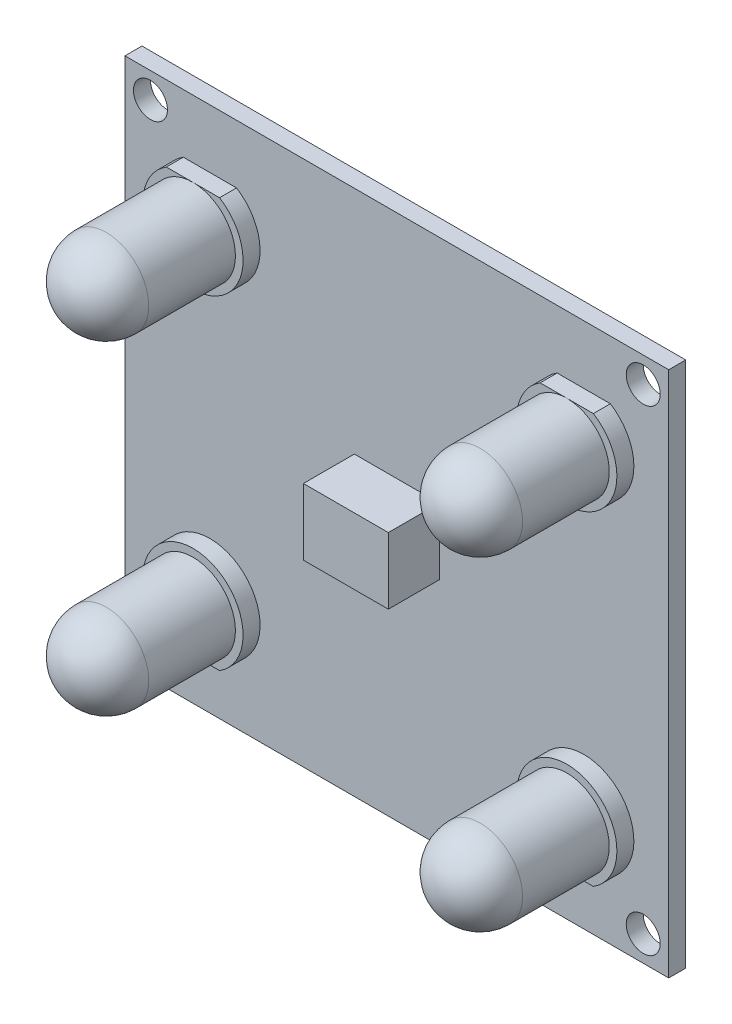
ISO-10303-21;
HEADER;
FILE_DESCRIPTION(('STEP AP214'),'2;1');
FILE_NAME('part.step','',(''),(''),'','','');
FILE_SCHEMA(('AUTOMOTIVE_DESIGN { 1 0 10303 214 1 1 1 1 }'));
ENDSEC;
DATA;
#1=APPLICATION_CONTEXT('core data for automotive mechanical design processes');
#2=APPLICATION_PROTOCOL_DEFINITION('international standard','automotive_design',2000,#1);
#3=PRODUCT_CONTEXT('',#1,'mechanical');
#4=PRODUCT('Part','Part','',(#3));
#5=PRODUCT_RELATED_PRODUCT_CATEGORY('part','',(#4));
#6=PRODUCT_DEFINITION_FORMATION('','',#4);
#7=PRODUCT_DEFINITION_CONTEXT('part definition',#1,'design');
#8=PRODUCT_DEFINITION('design','',#6,#7);
#9=PRODUCT_DEFINITION_SHAPE('','',#8);
#10=(LENGTH_UNIT() NAMED_UNIT(*) SI_UNIT(.MILLI.,.METRE.));
#11=(NAMED_UNIT(*) PLANE_ANGLE_UNIT() SI_UNIT($,.RADIAN.));
#12=(NAMED_UNIT(*) SI_UNIT($,.STERADIAN.) SOLID_ANGLE_UNIT());
#13=UNCERTAINTY_MEASURE_WITH_UNIT(LENGTH_MEASURE(1.E-05),#10,'distance_accuracy_value','');
#14=(GEOMETRIC_REPRESENTATION_CONTEXT(3) GLOBAL_UNCERTAINTY_ASSIGNED_CONTEXT((#13)) GLOBAL_UNIT_ASSIGNED_CONTEXT((#10,
#11,#12)) REPRESENTATION_CONTEXT('',''));
#15=CARTESIAN_POINT('',(0.,0.,0.));
#16=DIRECTION('',(0.,0.,1.));
#17=DIRECTION('',(1.,0.,0.));
#18=AXIS2_PLACEMENT_3D('',#15,#16,#17);
#19=CARTESIAN_POINT('',(-3.6257142857143,7.83026785714285,4.));
#20=DIRECTION('',(-1.,0.,0.));
#21=DIRECTION('',(0.,0.,1.));
#22=AXIS2_PLACEMENT_3D('',#19,#20,#21);
#23=PLANE('',#22);
#24=DIRECTION('',(0.,1.,0.));
#25=VECTOR('',#24,1.);
#26=CARTESIAN_POINT('',(-3.6257142857143,7.83026785714285,1.));
#27=LINE('',#26,#25);
#28=CARTESIAN_POINT('',(-3.6257142857143,3.92401785714286,1.));
#29=VERTEX_POINT('',#28);
#30=CARTESIAN_POINT('',(-3.6257142857143,7.83026785714285,1.));
#31=VERTEX_POINT('',#30);
#32=EDGE_CURVE('E116',#29,#31,#27,.T.);
#33=ORIENTED_EDGE('',*,*,#32,.T.);
#34=DIRECTION('',(0.,0.,-1.));
#35=VECTOR('',#34,1.);
#36=CARTESIAN_POINT('',(-3.6257142857143,7.83026785714285,4.));
#37=LINE('',#36,#35);
#38=CARTESIAN_POINT('',(-3.6257142857143,7.83026785714285,4.));
#39=VERTEX_POINT('',#38);
#40=EDGE_CURVE('E12',#39,#31,#37,.T.);
#41=ORIENTED_EDGE('',*,*,#40,.F.);
#42=DIRECTION('',(0.,1.,0.));
#43=VECTOR('',#42,1.);
#44=CARTESIAN_POINT('',(-3.6257142857143,7.83026785714285,4.));
#45=LINE('',#44,#43);
#46=CARTESIAN_POINT('',(-3.6257142857143,3.92401785714286,4.));
#47=VERTEX_POINT('',#46);
#48=EDGE_CURVE('E104',#47,#39,#45,.T.);
#49=ORIENTED_EDGE('',*,*,#48,.F.);
#50=DIRECTION('',(0.,0.,-1.));
#51=VECTOR('',#50,1.);
#52=CARTESIAN_POINT('',(-3.6257142857143,3.92401785714286,4.));
#53=LINE('',#52,#51);
#54=EDGE_CURVE('E112',#47,#29,#53,.T.);
#55=ORIENTED_EDGE('',*,*,#54,.T.);
#56=EDGE_LOOP('',(#33,#41,#49,#55));
#57=FACE_BOUND('',#56,.T.);
#58=ADVANCED_FACE('F53',(#57),#23,.F.);
#59=CARTESIAN_POINT('',(-8.6257142857143,7.83026785714285,4.));
#60=DIRECTION('',(0.,-1.,0.));
#61=DIRECTION('',(0.,0.,-1.));
#62=AXIS2_PLACEMENT_3D('',#59,#60,#61);
#63=PLANE('',#62);
#64=DIRECTION('',(-1.,0.,0.));
#65=VECTOR('',#64,1.);
#66=CARTESIAN_POINT('',(-8.6257142857143,7.83026785714285,1.));
#67=LINE('',#66,#65);
#68=CARTESIAN_POINT('',(-8.6257142857143,7.83026785714285,1.));
#69=VERTEX_POINT('',#68);
#70=EDGE_CURVE('E108',#31,#69,#67,.T.);
#71=ORIENTED_EDGE('',*,*,#70,.T.);
#72=DIRECTION('',(0.,0.,-1.));
#73=VECTOR('',#72,1.);
#74=CARTESIAN_POINT('',(-8.6257142857143,7.83026785714285,4.));
#75=LINE('',#74,#73);
#76=CARTESIAN_POINT('',(-8.6257142857143,7.83026785714285,4.));
#77=VERTEX_POINT('',#76);
#78=EDGE_CURVE('E61',#77,#69,#75,.T.);
#79=ORIENTED_EDGE('',*,*,#78,.F.);
#80=DIRECTION('',(-1.,0.,0.));
#81=VECTOR('',#80,1.);
#82=CARTESIAN_POINT('',(-8.6257142857143,7.83026785714285,4.));
#83=LINE('',#82,#81);
#84=EDGE_CURVE('E99',#39,#77,#83,.T.);
#85=ORIENTED_EDGE('',*,*,#84,.F.);
#86=ORIENTED_EDGE('',*,*,#40,.T.);
#87=EDGE_LOOP('',(#71,#79,#85,#86));
#88=FACE_BOUND('',#87,.T.);
#89=ADVANCED_FACE('F107',(#88),#63,.F.);
#90=CARTESIAN_POINT('',(-8.6257142857143,7.83026785714285,4.));
#91=DIRECTION('',(1.,0.,0.));
#92=DIRECTION('',(0.,0.,-1.));
#93=AXIS2_PLACEMENT_3D('',#90,#91,#92);
#94=PLANE('',#93);
#95=DIRECTION('',(0.,-1.,0.));
#96=VECTOR('',#95,1.);
#97=CARTESIAN_POINT('',(-8.6257142857143,7.83026785714285,1.));
#98=LINE('',#97,#96);
#99=CARTESIAN_POINT('',(-8.6257142857143,3.92401785714286,1.));
#100=VERTEX_POINT('',#99);
#101=EDGE_CURVE('E86',#69,#100,#98,.T.);
#102=ORIENTED_EDGE('',*,*,#101,.T.);
#103=DIRECTION('',(0.,0.,-1.));
#104=VECTOR('',#103,1.);
#105=CARTESIAN_POINT('',(-8.6257142857143,3.92401785714286,4.));
#106=LINE('',#105,#104);
#107=CARTESIAN_POINT('',(-8.6257142857143,3.92401785714286,4.));
#108=VERTEX_POINT('',#107);
#109=EDGE_CURVE('E109',#108,#100,#106,.T.);
#110=ORIENTED_EDGE('',*,*,#109,.F.);
#111=DIRECTION('',(0.,-1.,0.));
#112=VECTOR('',#111,1.);
#113=CARTESIAN_POINT('',(-8.6257142857143,7.83026785714285,4.));
#114=LINE('',#113,#112);
#115=EDGE_CURVE('E102',#77,#108,#114,.T.);
#116=ORIENTED_EDGE('',*,*,#115,.F.);
#117=ORIENTED_EDGE('',*,*,#78,.T.);
#118=EDGE_LOOP('',(#102,#110,#116,#117));
#119=FACE_BOUND('',#118,.T.);
#120=ADVANCED_FACE('F110',(#119),#94,.F.);
#121=CARTESIAN_POINT('',(-8.6257142857143,3.92401785714286,4.));
#122=DIRECTION('',(0.,1.,0.));
#123=DIRECTION('',(0.,0.,1.));
#124=AXIS2_PLACEMENT_3D('',#121,#122,#123);
#125=PLANE('',#124);
#126=DIRECTION('',(1.,0.,0.));
#127=VECTOR('',#126,1.);
#128=CARTESIAN_POINT('',(-8.6257142857143,3.92401785714286,1.));
#129=LINE('',#128,#127);
#130=EDGE_CURVE('E92',#100,#29,#129,.T.);
#131=ORIENTED_EDGE('',*,*,#130,.T.);
#132=ORIENTED_EDGE('',*,*,#54,.F.);
#133=DIRECTION('',(1.,0.,0.));
#134=VECTOR('',#133,1.);
#135=CARTESIAN_POINT('',(-8.6257142857143,3.92401785714286,4.));
#136=LINE('',#135,#134);
#137=EDGE_CURVE('E69',#108,#47,#136,.T.);
#138=ORIENTED_EDGE('',*,*,#137,.F.);
#139=ORIENTED_EDGE('',*,*,#109,.T.);
#140=EDGE_LOOP('',(#131,#132,#138,#139));
#141=FACE_BOUND('',#140,.T.);
#142=ADVANCED_FACE('F123',(#141),#125,.F.);
#143=CARTESIAN_POINT('',(0.,0.,4.));
#144=DIRECTION('',(0.,0.,1.));
#145=DIRECTION('',(1.,0.,0.));
#146=AXIS2_PLACEMENT_3D('',#143,#144,#145);
#147=PLANE('',#146);
#148=ORIENTED_EDGE('',*,*,#48,.T.);
#149=ORIENTED_EDGE('',*,*,#84,.T.);
#150=ORIENTED_EDGE('',*,*,#115,.T.);
#151=ORIENTED_EDGE('',*,*,#137,.T.);
#152=EDGE_LOOP('',(#148,#149,#150,#151));
#153=FACE_BOUND('',#152,.T.);
#154=ADVANCED_FACE('F100',(#153),#147,.T.);
#155=CARTESIAN_POINT('',(0.,0.,1.));
#156=DIRECTION('',(0.,0.,1.));
#157=DIRECTION('',(1.,0.,0.));
#158=AXIS2_PLACEMENT_3D('',#155,#156,#157);
#159=PLANE('',#158);
#160=ORIENTED_EDGE('',*,*,#32,.F.);
#161=ORIENTED_EDGE('',*,*,#130,.F.);
#162=ORIENTED_EDGE('',*,*,#101,.F.);
#163=ORIENTED_EDGE('',*,*,#70,.F.);
#164=EDGE_LOOP('',(#160,#161,#162,#163));
#165=FACE_BOUND('',#164,.T.);
#166=ADVANCED_FACE('F126',(#165),#159,.F.);
#167=CLOSED_SHELL('',(#58,#89,#120,#142,#154,#166));
#168=MANIFOLD_SOLID_BREP('B2',#167);
#169=CARTESIAN_POINT('',(4.8742857142857,15.4271428571429,9.6));
#170=DIRECTION('',(0.,0.,-1.));
#171=DIRECTION('',(-1.,0.,0.));
#172=AXIS2_PLACEMENT_3D('',#169,#170,#171);
#173=CYLINDRICAL_SURFACE('',#172,2.5);
#174=CARTESIAN_POINT('',(4.8742857142857,15.4271428571429,7.1));
#175=DIRECTION('',(0.,0.,-1.));
#176=DIRECTION('',(-1.,0.,0.));
#177=AXIS2_PLACEMENT_3D('',#174,#175,#176);
#178=CIRCLE('',#177,2.5);
#179=CARTESIAN_POINT('',(2.3742857142857,15.4271428571429,7.1));
#180=VERTEX_POINT('',#179);
#181=EDGE_CURVE('E52',#180,#180,#178,.T.);
#182=ORIENTED_EDGE('',*,*,#181,.T.);
#183=EDGE_LOOP('',(#182));
#184=FACE_BOUND('',#183,.T.);
#185=CARTESIAN_POINT('',(4.8742857142857,15.4271428571429,2.));
#186=DIRECTION('',(0.,0.,1.));
#187=DIRECTION('',(1.,0.,0.));
#188=AXIS2_PLACEMENT_3D('',#185,#186,#187);
#189=CIRCLE('',#188,2.5);
#190=CARTESIAN_POINT('',(7.3742857142857,15.4271428571429,2.));
#191=VERTEX_POINT('',#190);
#192=EDGE_CURVE('E203',#191,#191,#189,.T.);
#193=ORIENTED_EDGE('',*,*,#192,.T.);
#194=EDGE_LOOP('',(#193));
#195=FACE_BOUND('',#194,.T.);
#196=ADVANCED_FACE('F196',(#184,#195),#173,.T.);
#197=CARTESIAN_POINT('',(4.8742857142857,15.4271428571429,2.));
#198=DIRECTION('',(0.,0.,1.));
#199=DIRECTION('',(1.,0.,0.));
#200=AXIS2_PLACEMENT_3D('',#197,#198,#199);
#201=PLANE('',#200);
#202=ORIENTED_EDGE('',*,*,#192,.F.);
#203=EDGE_LOOP('',(#202));
#204=FACE_BOUND('',#203,.T.);
#205=ADVANCED_FACE('F210',(#204),#201,.F.);
#206=CARTESIAN_POINT('',(4.8742857142857,15.4271428571429,7.1));
#207=DIRECTION('',(0.,0.,1.));
#208=DIRECTION('',(1.,0.,0.));
#209=AXIS2_PLACEMENT_3D('',#206,#207,#208);
#210=SPHERICAL_SURFACE('',#209,2.5);
#211=ORIENTED_EDGE('',*,*,#181,.F.);
#212=EDGE_LOOP('',(#211));
#213=FACE_BOUND('',#212,.T.);
#214=ADVANCED_FACE('F198',(#213),#210,.T.);
#215=CLOSED_SHELL('',(#196,#205,#214));
#216=MANIFOLD_SOLID_BREP('B6',#215);
#217=CARTESIAN_POINT('',(4.8742857142857,-3.67285714285715,9.6));
#218=DIRECTION('',(0.,0.,-1.));
#219=DIRECTION('',(-1.,0.,0.));
#220=AXIS2_PLACEMENT_3D('',#217,#218,#219);
#221=CYLINDRICAL_SURFACE('',#220,2.5);
#222=CARTESIAN_POINT('',(4.8742857142857,-3.67285714285715,7.1));
#223=DIRECTION('',(0.,0.,-1.));
#224=DIRECTION('',(-1.,0.,0.));
#225=AXIS2_PLACEMENT_3D('',#222,#223,#224);
#226=CIRCLE('',#225,2.5);
#227=CARTESIAN_POINT('',(2.3742857142857,-3.67285714285715,7.1));
#228=VERTEX_POINT('',#227);
#229=EDGE_CURVE('E195',#228,#228,#226,.T.);
#230=ORIENTED_EDGE('',*,*,#229,.T.);
#231=EDGE_LOOP('',(#230));
#232=FACE_BOUND('',#231,.T.);
#233=CARTESIAN_POINT('',(4.8742857142857,-3.67285714285715,2.));
#234=DIRECTION('',(0.,0.,1.));
#235=DIRECTION('',(1.,0.,0.));
#236=AXIS2_PLACEMENT_3D('',#233,#234,#235);
#237=CIRCLE('',#236,2.5);
#238=CARTESIAN_POINT('',(7.3742857142857,-3.67285714285715,2.));
#239=VERTEX_POINT('',#238);
#240=EDGE_CURVE('E257',#239,#239,#237,.T.);
#241=ORIENTED_EDGE('',*,*,#240,.T.);
#242=EDGE_LOOP('',(#241));
#243=FACE_BOUND('',#242,.T.);
#244=ADVANCED_FACE('F250',(#232,#243),#221,.T.);
#245=CARTESIAN_POINT('',(4.8742857142857,-3.67285714285715,2.));
#246=DIRECTION('',(0.,0.,1.));
#247=DIRECTION('',(1.,0.,0.));
#248=AXIS2_PLACEMENT_3D('',#245,#246,#247);
#249=PLANE('',#248);
#250=ORIENTED_EDGE('',*,*,#240,.F.);
#251=EDGE_LOOP('',(#250));
#252=FACE_BOUND('',#251,.T.);
#253=ADVANCED_FACE('F264',(#252),#249,.F.);
#254=CARTESIAN_POINT('',(4.8742857142857,-3.67285714285715,7.1));
#255=DIRECTION('',(0.,0.,1.));
#256=DIRECTION('',(1.,0.,0.));
#257=AXIS2_PLACEMENT_3D('',#254,#255,#256);
#258=SPHERICAL_SURFACE('',#257,2.5);
#259=ORIENTED_EDGE('',*,*,#229,.F.);
#260=EDGE_LOOP('',(#259));
#261=FACE_BOUND('',#260,.T.);
#262=ADVANCED_FACE('F252',(#261),#258,.T.);
#263=CLOSED_SHELL('',(#244,#253,#262));
#264=MANIFOLD_SOLID_BREP('B47',#263);
#265=CARTESIAN_POINT('',(-17.1257142857143,-3.67285714285715,9.6));
#266=DIRECTION('',(0.,0.,-1.));
#267=DIRECTION('',(-1.,0.,0.));
#268=AXIS2_PLACEMENT_3D('',#265,#266,#267);
#269=CYLINDRICAL_SURFACE('',#268,2.5);
#270=CARTESIAN_POINT('',(-17.1257142857143,-3.67285714285715,7.1));
#271=DIRECTION('',(0.,0.,-1.));
#272=DIRECTION('',(-1.,0.,0.));
#273=AXIS2_PLACEMENT_3D('',#270,#271,#272);
#274=CIRCLE('',#273,2.5);
#275=CARTESIAN_POINT('',(-19.6257142857143,-3.67285714285715,7.1));
#276=VERTEX_POINT('',#275);
#277=EDGE_CURVE('E249',#276,#276,#274,.T.);
#278=ORIENTED_EDGE('',*,*,#277,.T.);
#279=EDGE_LOOP('',(#278));
#280=FACE_BOUND('',#279,.T.);
#281=CARTESIAN_POINT('',(-17.1257142857143,-3.67285714285715,2.));
#282=DIRECTION('',(0.,0.,1.));
#283=DIRECTION('',(1.,0.,0.));
#284=AXIS2_PLACEMENT_3D('',#281,#282,#283);
#285=CIRCLE('',#284,2.5);
#286=CARTESIAN_POINT('',(-14.6257142857143,-3.67285714285715,2.));
#287=VERTEX_POINT('',#286);
#288=EDGE_CURVE('E311',#287,#287,#285,.T.);
#289=ORIENTED_EDGE('',*,*,#288,.T.);
#290=EDGE_LOOP('',(#289));
#291=FACE_BOUND('',#290,.T.);
#292=ADVANCED_FACE('F304',(#280,#291),#269,.T.);
#293=CARTESIAN_POINT('',(-17.1257142857143,-3.67285714285715,2.));
#294=DIRECTION('',(0.,0.,1.));
#295=DIRECTION('',(1.,0.,0.));
#296=AXIS2_PLACEMENT_3D('',#293,#294,#295);
#297=PLANE('',#296);
#298=ORIENTED_EDGE('',*,*,#288,.F.);
#299=EDGE_LOOP('',(#298));
#300=FACE_BOUND('',#299,.T.);
#301=ADVANCED_FACE('F318',(#300),#297,.F.);
#302=CARTESIAN_POINT('',(-17.1257142857143,-3.67285714285715,7.1));
#303=DIRECTION('',(0.,0.,1.));
#304=DIRECTION('',(1.,0.,0.));
#305=AXIS2_PLACEMENT_3D('',#302,#303,#304);
#306=SPHERICAL_SURFACE('',#305,2.5);
#307=ORIENTED_EDGE('',*,*,#277,.F.);
#308=EDGE_LOOP('',(#307));
#309=FACE_BOUND('',#308,.T.);
#310=ADVANCED_FACE('F306',(#309),#306,.T.);
#311=CLOSED_SHELL('',(#292,#301,#310));
#312=MANIFOLD_SOLID_BREP('B190',#311);
#313=CARTESIAN_POINT('',(-17.1257142857143,15.4271428571429,9.6));
#314=DIRECTION('',(0.,0.,-1.));
#315=DIRECTION('',(-1.,0.,0.));
#316=AXIS2_PLACEMENT_3D('',#313,#314,#315);
#317=CYLINDRICAL_SURFACE('',#316,2.5);
#318=CARTESIAN_POINT('',(-17.1257142857143,15.4271428571429,7.1));
#319=DIRECTION('',(0.,0.,-1.));
#320=DIRECTION('',(-1.,0.,0.));
#321=AXIS2_PLACEMENT_3D('',#318,#319,#320);
#322=CIRCLE('',#321,2.5);
#323=CARTESIAN_POINT('',(-19.6257142857143,15.4271428571429,7.1));
#324=VERTEX_POINT('',#323);
#325=EDGE_CURVE('E303',#324,#324,#322,.T.);
#326=ORIENTED_EDGE('',*,*,#325,.T.);
#327=EDGE_LOOP('',(#326));
#328=FACE_BOUND('',#327,.T.);
#329=CARTESIAN_POINT('',(-17.1257142857143,15.4271428571429,2.));
#330=DIRECTION('',(0.,0.,1.));
#331=DIRECTION('',(1.,0.,0.));
#332=AXIS2_PLACEMENT_3D('',#329,#330,#331);
#333=CIRCLE('',#332,2.5);
#334=CARTESIAN_POINT('',(-14.6257142857143,15.4271428571429,2.));
#335=VERTEX_POINT('',#334);
#336=EDGE_CURVE('E367',#335,#335,#333,.T.);
#337=ORIENTED_EDGE('',*,*,#336,.T.);
#338=EDGE_LOOP('',(#337));
#339=FACE_BOUND('',#338,.T.);
#340=ADVANCED_FACE('F360',(#328,#339),#317,.T.);
#341=CARTESIAN_POINT('',(-17.1257142857143,15.4271428571429,2.));
#342=DIRECTION('',(0.,0.,1.));
#343=DIRECTION('',(1.,0.,0.));
#344=AXIS2_PLACEMENT_3D('',#341,#342,#343);
#345=PLANE('',#344);
#346=ORIENTED_EDGE('',*,*,#336,.F.);
#347=EDGE_LOOP('',(#346));
#348=FACE_BOUND('',#347,.T.);
#349=ADVANCED_FACE('F374',(#348),#345,.F.);
#350=CARTESIAN_POINT('',(-17.1257142857143,15.4271428571429,7.1));
#351=DIRECTION('',(0.,0.,1.));
#352=DIRECTION('',(1.,0.,0.));
#353=AXIS2_PLACEMENT_3D('',#350,#351,#352);
#354=SPHERICAL_SURFACE('',#353,2.5);
#355=ORIENTED_EDGE('',*,*,#325,.F.);
#356=EDGE_LOOP('',(#355));
#357=FACE_BOUND('',#356,.T.);
#358=ADVANCED_FACE('F362',(#357),#354,.T.);
#359=CLOSED_SHELL('',(#340,#349,#358));
#360=MANIFOLD_SOLID_BREP('B244',#359);
#361=CARTESIAN_POINT('',(4.8742857142857,-3.67285714285715,2.));
#362=DIRECTION('',(0.,0.,-1.));
#363=DIRECTION('',(-1.,0.,0.));
#364=AXIS2_PLACEMENT_3D('',#361,#362,#363);
#365=CYLINDRICAL_SURFACE('',#364,2.95);
#366=CARTESIAN_POINT('',(4.8742857142857,-3.67285714285715,2.));
#367=DIRECTION('',(0.,0.,1.));
#368=DIRECTION('',(1.,0.,0.));
#369=AXIS2_PLACEMENT_3D('',#366,#367,#368);
#370=CIRCLE('',#369,2.95);
#371=CARTESIAN_POINT('',(6.43936341318283,-6.17346342862364,2.));
#372=VERTEX_POINT('',#371);
#373=CARTESIAN_POINT('',(3.30920801538858,-6.17346342862364,2.));
#374=VERTEX_POINT('',#373);
#375=EDGE_CURVE('E446',#372,#374,#370,.T.);
#376=ORIENTED_EDGE('',*,*,#375,.F.);
#377=DIRECTION('',(0.,0.,-1.));
#378=VECTOR('',#377,1.);
#379=CARTESIAN_POINT('',(6.43936341318282,-6.17346342862364,2.));
#380=LINE('',#379,#378);
#381=CARTESIAN_POINT('',(6.43936341318283,-6.17346342862364,1.));
#382=VERTEX_POINT('',#381);
#383=EDGE_CURVE('E438',#372,#382,#380,.T.);
#384=ORIENTED_EDGE('',*,*,#383,.T.);
#385=CARTESIAN_POINT('',(4.8742857142857,-3.67285714285715,1.));
#386=DIRECTION('',(0.,0.,1.));
#387=DIRECTION('',(1.,0.,0.));
#388=AXIS2_PLACEMENT_3D('',#385,#386,#387);
#389=CIRCLE('',#388,2.95);
#390=CARTESIAN_POINT('',(3.30920801538858,-6.17346342862364,1.));
#391=VERTEX_POINT('',#390);
#392=EDGE_CURVE('E424',#382,#391,#389,.T.);
#393=ORIENTED_EDGE('',*,*,#392,.T.);
#394=DIRECTION('',(0.,0.,-1.));
#395=VECTOR('',#394,1.);
#396=CARTESIAN_POINT('',(3.30920801538858,-6.17346342862364,2.));
#397=LINE('',#396,#395);
#398=EDGE_CURVE('E431',#391,#374,#397,.F.);
#399=ORIENTED_EDGE('',*,*,#398,.T.);
#400=EDGE_LOOP('',(#376,#384,#393,#399));
#401=FACE_BOUND('',#400,.T.);
#402=ADVANCED_FACE('F416',(#401),#365,.T.);
#403=CARTESIAN_POINT('',(4.8742857142857,-3.67285714285715,2.));
#404=DIRECTION('',(0.,0.,1.));
#405=DIRECTION('',(1.,0.,0.));
#406=AXIS2_PLACEMENT_3D('',#403,#404,#405);
#407=PLANE('',#406);
#408=DIRECTION('',(-1.,0.,0.));
#409=VECTOR('',#408,1.);
#410=CARTESIAN_POINT('',(-21.5331399288377,-6.17346342862364,2.));
#411=LINE('',#410,#409);
#412=EDGE_CURVE('E441',#372,#374,#411,.T.);
#413=ORIENTED_EDGE('',*,*,#412,.F.);
#414=ORIENTED_EDGE('',*,*,#375,.T.);
#415=EDGE_LOOP('',(#413,#414));
#416=FACE_BOUND('',#415,.T.);
#417=ADVANCED_FACE('F418',(#416),#407,.T.);
#418=CARTESIAN_POINT('',(4.8742857142857,-3.67285714285715,1.));
#419=DIRECTION('',(0.,0.,1.));
#420=DIRECTION('',(1.,0.,0.));
#421=AXIS2_PLACEMENT_3D('',#418,#419,#420);
#422=PLANE('',#421);
#423=ORIENTED_EDGE('',*,*,#392,.F.);
#424=DIRECTION('',(-1.,0.,0.));
#425=VECTOR('',#424,1.);
#426=CARTESIAN_POINT('',(4.8742857142857,-6.17346342862364,1.));
#427=LINE('',#426,#425);
#428=EDGE_CURVE('E358',#382,#391,#427,.T.);
#429=ORIENTED_EDGE('',*,*,#428,.T.);
#430=EDGE_LOOP('',(#423,#429));
#431=FACE_BOUND('',#430,.T.);
#432=ADVANCED_FACE('F454',(#431),#422,.F.);
#433=CARTESIAN_POINT('',(-21.5331399288377,-6.17346342862364,1.));
#434=DIRECTION('',(0.,1.,0.));
#435=DIRECTION('',(0.,0.,1.));
#436=AXIS2_PLACEMENT_3D('',#433,#434,#435);
#437=PLANE('',#436);
#438=ORIENTED_EDGE('',*,*,#412,.T.);
#439=ORIENTED_EDGE('',*,*,#398,.F.);
#440=ORIENTED_EDGE('',*,*,#428,.F.);
#441=ORIENTED_EDGE('',*,*,#383,.F.);
#442=EDGE_LOOP('',(#438,#439,#440,#441));
#443=FACE_BOUND('',#442,.T.);
#444=ADVANCED_FACE('F440',(#443),#437,.F.);
#445=CLOSED_SHELL('',(#402,#417,#432,#444));
#446=MANIFOLD_SOLID_BREP('B298',#445);
#447=CARTESIAN_POINT('',(4.8742857142857,15.4271428571429,2.));
#448=DIRECTION('',(0.,0.,-1.));
#449=DIRECTION('',(-1.,0.,0.));
#450=AXIS2_PLACEMENT_3D('',#447,#448,#449);
#451=CYLINDRICAL_SURFACE('',#450,2.95);
#452=CARTESIAN_POINT('',(4.8742857142857,15.4271428571429,2.));
#453=DIRECTION('',(0.,0.,1.));
#454=DIRECTION('',(1.,0.,0.));
#455=AXIS2_PLACEMENT_3D('',#452,#453,#454);
#456=CIRCLE('',#455,2.95);
#457=CARTESIAN_POINT('',(3.30823973794912,17.9271428571429,2.));
#458=VERTEX_POINT('',#457);
#459=CARTESIAN_POINT('',(6.44033169062228,17.9271428571429,2.));
#460=VERTEX_POINT('',#459);
#461=EDGE_CURVE('E535',#458,#460,#456,.T.);
#462=ORIENTED_EDGE('',*,*,#461,.F.);
#463=DIRECTION('',(0.,0.,-1.));
#464=VECTOR('',#463,1.);
#465=CARTESIAN_POINT('',(3.30823973794912,17.9271428571429,2.));
#466=LINE('',#465,#464);
#467=CARTESIAN_POINT('',(3.30823973794912,17.9271428571429,1.));
#468=VERTEX_POINT('',#467);
#469=EDGE_CURVE('E527',#458,#468,#466,.T.);
#470=ORIENTED_EDGE('',*,*,#469,.T.);
#471=CARTESIAN_POINT('',(4.8742857142857,15.4271428571429,1.));
#472=DIRECTION('',(0.,0.,1.));
#473=DIRECTION('',(1.,0.,0.));
#474=AXIS2_PLACEMENT_3D('',#471,#472,#473);
#475=CIRCLE('',#474,2.95);
#476=CARTESIAN_POINT('',(6.44033169062228,17.9271428571429,1.));
#477=VERTEX_POINT('',#476);
#478=EDGE_CURVE('E513',#468,#477,#475,.T.);
#479=ORIENTED_EDGE('',*,*,#478,.T.);
#480=DIRECTION('',(0.,0.,-1.));
#481=VECTOR('',#480,1.);
#482=CARTESIAN_POINT('',(6.44033169062228,17.9271428571429,2.));
#483=LINE('',#482,#481);
#484=EDGE_CURVE('E520',#477,#460,#483,.F.);
#485=ORIENTED_EDGE('',*,*,#484,.T.);
#486=EDGE_LOOP('',(#462,#470,#479,#485));
#487=FACE_BOUND('',#486,.T.);
#488=ADVANCED_FACE('F505',(#487),#451,.T.);
#489=CARTESIAN_POINT('',(4.8742857142857,15.4271428571429,2.));
#490=DIRECTION('',(0.,0.,1.));
#491=DIRECTION('',(1.,0.,0.));
#492=AXIS2_PLACEMENT_3D('',#489,#490,#491);
#493=PLANE('',#492);
#494=DIRECTION('',(1.,0.,0.));
#495=VECTOR('',#494,1.);
#496=CARTESIAN_POINT('',(-15.5596683093777,17.9271428571429,2.));
#497=LINE('',#496,#495);
#498=EDGE_CURVE('E530',#458,#460,#497,.T.);
#499=ORIENTED_EDGE('',*,*,#498,.F.);
#500=ORIENTED_EDGE('',*,*,#461,.T.);
#501=EDGE_LOOP('',(#499,#500));
#502=FACE_BOUND('',#501,.T.);
#503=ADVANCED_FACE('F507',(#502),#493,.T.);
#504=CARTESIAN_POINT('',(4.8742857142857,15.4271428571429,1.));
#505=DIRECTION('',(0.,0.,1.));
#506=DIRECTION('',(1.,0.,0.));
#507=AXIS2_PLACEMENT_3D('',#504,#505,#506);
#508=PLANE('',#507);
#509=ORIENTED_EDGE('',*,*,#478,.F.);
#510=DIRECTION('',(1.,0.,0.));
#511=VECTOR('',#510,1.);
#512=CARTESIAN_POINT('',(4.8742857142857,17.9271428571429,1.));
#513=LINE('',#512,#511);
#514=EDGE_CURVE('E414',#468,#477,#513,.T.);
#515=ORIENTED_EDGE('',*,*,#514,.T.);
#516=EDGE_LOOP('',(#509,#515));
#517=FACE_BOUND('',#516,.T.);
#518=ADVANCED_FACE('F543',(#517),#508,.F.);
#519=CARTESIAN_POINT('',(-15.5596683093777,17.9271428571429,1.));
#520=DIRECTION('',(0.,-1.,0.));
#521=DIRECTION('',(0.,0.,-1.));
#522=AXIS2_PLACEMENT_3D('',#519,#520,#521);
#523=PLANE('',#522);
#524=ORIENTED_EDGE('',*,*,#498,.T.);
#525=ORIENTED_EDGE('',*,*,#484,.F.);
#526=ORIENTED_EDGE('',*,*,#514,.F.);
#527=ORIENTED_EDGE('',*,*,#469,.F.);
#528=EDGE_LOOP('',(#524,#525,#526,#527));
#529=FACE_BOUND('',#528,.T.);
#530=ADVANCED_FACE('F529',(#529),#523,.F.);
#531=CLOSED_SHELL('',(#488,#503,#518,#530));
#532=MANIFOLD_SOLID_BREP('B352',#531);
#533=CARTESIAN_POINT('',(-17.1257142857143,-3.67285714285715,2.));
#534=DIRECTION('',(0.,0.,-1.));
#535=DIRECTION('',(-1.,0.,0.));
#536=AXIS2_PLACEMENT_3D('',#533,#534,#535);
#537=CYLINDRICAL_SURFACE('',#536,2.95);
#538=CARTESIAN_POINT('',(-17.1257142857143,-3.67285714285715,2.));
#539=DIRECTION('',(0.,0.,1.));
#540=DIRECTION('',(1.,0.,0.));
#541=AXIS2_PLACEMENT_3D('',#538,#539,#540);
#542=CIRCLE('',#541,2.95);
#543=CARTESIAN_POINT('',(-15.5606365868172,-6.17346342862364,2.));
#544=VERTEX_POINT('',#543);
#545=CARTESIAN_POINT('',(-18.6907919846114,-6.17346342862364,2.));
#546=VERTEX_POINT('',#545);
#547=EDGE_CURVE('E624',#544,#546,#542,.T.);
#548=ORIENTED_EDGE('',*,*,#547,.F.);
#549=DIRECTION('',(0.,0.,-1.));
#550=VECTOR('',#549,1.);
#551=CARTESIAN_POINT('',(-15.5606365868172,-6.17346342862364,2.));
#552=LINE('',#551,#550);
#553=CARTESIAN_POINT('',(-15.5606365868172,-6.17346342862364,1.));
#554=VERTEX_POINT('',#553);
#555=EDGE_CURVE('E616',#544,#554,#552,.T.);
#556=ORIENTED_EDGE('',*,*,#555,.T.);
#557=CARTESIAN_POINT('',(-17.1257142857143,-3.67285714285715,1.));
#558=DIRECTION('',(0.,0.,1.));
#559=DIRECTION('',(1.,0.,0.));
#560=AXIS2_PLACEMENT_3D('',#557,#558,#559);
#561=CIRCLE('',#560,2.95);
#562=CARTESIAN_POINT('',(-18.6907919846114,-6.17346342862364,1.));
#563=VERTEX_POINT('',#562);
#564=EDGE_CURVE('E602',#554,#563,#561,.T.);
#565=ORIENTED_EDGE('',*,*,#564,.T.);
#566=DIRECTION('',(0.,0.,-1.));
#567=VECTOR('',#566,1.);
#568=CARTESIAN_POINT('',(-18.6907919846114,-6.17346342862364,2.));
#569=LINE('',#568,#567);
#570=EDGE_CURVE('E609',#563,#546,#569,.F.);
#571=ORIENTED_EDGE('',*,*,#570,.T.);
#572=EDGE_LOOP('',(#548,#556,#565,#571));
#573=FACE_BOUND('',#572,.T.);
#574=ADVANCED_FACE('F594',(#573),#537,.T.);
#575=CARTESIAN_POINT('',(-17.1257142857143,-3.67285714285715,2.));
#576=DIRECTION('',(0.,0.,1.));
#577=DIRECTION('',(1.,0.,0.));
#578=AXIS2_PLACEMENT_3D('',#575,#576,#577);
#579=PLANE('',#578);
#580=DIRECTION('',(-1.,0.,0.));
#581=VECTOR('',#580,1.);
#582=CARTESIAN_POINT('',(-21.5331399288377,-6.17346342862364,2.));
#583=LINE('',#582,#581);
#584=EDGE_CURVE('E619',#544,#546,#583,.T.);
#585=ORIENTED_EDGE('',*,*,#584,.F.);
#586=ORIENTED_EDGE('',*,*,#547,.T.);
#587=EDGE_LOOP('',(#585,#586));
#588=FACE_BOUND('',#587,.T.);
#589=ADVANCED_FACE('F596',(#588),#579,.T.);
#590=CARTESIAN_POINT('',(-17.1257142857143,-3.67285714285715,1.));
#591=DIRECTION('',(0.,0.,1.));
#592=DIRECTION('',(1.,0.,0.));
#593=AXIS2_PLACEMENT_3D('',#590,#591,#592);
#594=PLANE('',#593);
#595=ORIENTED_EDGE('',*,*,#564,.F.);
#596=DIRECTION('',(-1.,0.,0.));
#597=VECTOR('',#596,1.);
#598=CARTESIAN_POINT('',(-17.1257142857143,-6.17346342862364,1.));
#599=LINE('',#598,#597);
#600=EDGE_CURVE('E503',#554,#563,#599,.T.);
#601=ORIENTED_EDGE('',*,*,#600,.T.);
#602=EDGE_LOOP('',(#595,#601));
#603=FACE_BOUND('',#602,.T.);
#604=ADVANCED_FACE('F632',(#603),#594,.F.);
#605=CARTESIAN_POINT('',(-21.5331399288377,-6.17346342862364,1.));
#606=DIRECTION('',(0.,1.,0.));
#607=DIRECTION('',(0.,0.,1.));
#608=AXIS2_PLACEMENT_3D('',#605,#606,#607);
#609=PLANE('',#608);
#610=ORIENTED_EDGE('',*,*,#584,.T.);
#611=ORIENTED_EDGE('',*,*,#570,.F.);
#612=ORIENTED_EDGE('',*,*,#600,.F.);
#613=ORIENTED_EDGE('',*,*,#555,.F.);
#614=EDGE_LOOP('',(#610,#611,#612,#613));
#615=FACE_BOUND('',#614,.T.);
#616=ADVANCED_FACE('F618',(#615),#609,.F.);
#617=CLOSED_SHELL('',(#574,#589,#604,#616));
#618=MANIFOLD_SOLID_BREP('B408',#617);
#619=CARTESIAN_POINT('',(-17.1257142857143,15.4271428571429,2.));
#620=DIRECTION('',(0.,0.,-1.));
#621=DIRECTION('',(-1.,0.,0.));
#622=AXIS2_PLACEMENT_3D('',#619,#620,#621);
#623=CYLINDRICAL_SURFACE('',#622,2.95);
#624=CARTESIAN_POINT('',(-17.1257142857143,15.4271428571429,2.));
#625=DIRECTION('',(0.,0.,1.));
#626=DIRECTION('',(1.,0.,0.));
#627=AXIS2_PLACEMENT_3D('',#624,#625,#626);
#628=CIRCLE('',#627,2.95);
#629=CARTESIAN_POINT('',(-18.6917602620509,17.9271428571429,2.));
#630=VERTEX_POINT('',#629);
#631=CARTESIAN_POINT('',(-15.5596683093777,17.9271428571429,2.));
#632=VERTEX_POINT('',#631);
#633=EDGE_CURVE('E689',#630,#632,#628,.T.);
#634=ORIENTED_EDGE('',*,*,#633,.F.);
#635=DIRECTION('',(0.,0.,-1.));
#636=VECTOR('',#635,1.);
#637=CARTESIAN_POINT('',(-18.6917602620509,17.9271428571429,2.));
#638=LINE('',#637,#636);
#639=CARTESIAN_POINT('',(-18.6917602620509,17.9271428571429,1.));
#640=VERTEX_POINT('',#639);
#641=EDGE_CURVE('E703',#630,#640,#638,.T.);
#642=ORIENTED_EDGE('',*,*,#641,.T.);
#643=CARTESIAN_POINT('',(-17.1257142857143,15.4271428571429,1.));
#644=DIRECTION('',(0.,0.,1.));
#645=DIRECTION('',(1.,0.,0.));
#646=AXIS2_PLACEMENT_3D('',#643,#644,#645);
#647=CIRCLE('',#646,2.95);
#648=CARTESIAN_POINT('',(-15.5596683093777,17.9271428571429,1.));
#649=VERTEX_POINT('',#648);
#650=EDGE_CURVE('E711',#640,#649,#647,.T.);
#651=ORIENTED_EDGE('',*,*,#650,.T.);
#652=DIRECTION('',(0.,0.,-1.));
#653=VECTOR('',#652,1.);
#654=CARTESIAN_POINT('',(-15.5596683093777,17.9271428571429,2.));
#655=LINE('',#654,#653);
#656=EDGE_CURVE('E696',#649,#632,#655,.F.);
#657=ORIENTED_EDGE('',*,*,#656,.T.);
#658=EDGE_LOOP('',(#634,#642,#651,#657));
#659=FACE_BOUND('',#658,.T.);
#660=ADVANCED_FACE('F682',(#659),#623,.T.);
#661=CARTESIAN_POINT('',(-17.1257142857143,15.4271428571429,2.));
#662=DIRECTION('',(0.,0.,1.));
#663=DIRECTION('',(1.,0.,0.));
#664=AXIS2_PLACEMENT_3D('',#661,#662,#663);
#665=PLANE('',#664);
#666=DIRECTION('',(1.,0.,0.));
#667=VECTOR('',#666,1.);
#668=CARTESIAN_POINT('',(-17.1257142857143,17.9271428571429,2.));
#669=LINE('',#668,#667);
#670=EDGE_CURVE('E706',#630,#632,#669,.T.);
#671=ORIENTED_EDGE('',*,*,#670,.F.);
#672=ORIENTED_EDGE('',*,*,#633,.T.);
#673=EDGE_LOOP('',(#671,#672));
#674=FACE_BOUND('',#673,.T.);
#675=ADVANCED_FACE('F715',(#674),#665,.T.);
#676=CARTESIAN_POINT('',(-17.1257142857143,15.4271428571429,1.));
#677=DIRECTION('',(0.,0.,1.));
#678=DIRECTION('',(1.,0.,0.));
#679=AXIS2_PLACEMENT_3D('',#676,#677,#678);
#680=PLANE('',#679);
#681=ORIENTED_EDGE('',*,*,#650,.F.);
#682=DIRECTION('',(1.,0.,0.));
#683=VECTOR('',#682,1.);
#684=CARTESIAN_POINT('',(-17.1257142857143,17.9271428571429,1.));
#685=LINE('',#684,#683);
#686=EDGE_CURVE('E592',#640,#649,#685,.T.);
#687=ORIENTED_EDGE('',*,*,#686,.T.);
#688=EDGE_LOOP('',(#681,#687));
#689=FACE_BOUND('',#688,.T.);
#690=ADVANCED_FACE('F720',(#689),#680,.F.);
#691=CARTESIAN_POINT('',(-17.1257142857143,17.9271428571429,1.));
#692=DIRECTION('',(0.,-1.,0.));
#693=DIRECTION('',(0.,0.,-1.));
#694=AXIS2_PLACEMENT_3D('',#691,#692,#693);
#695=PLANE('',#694);
#696=ORIENTED_EDGE('',*,*,#670,.T.);
#697=ORIENTED_EDGE('',*,*,#656,.F.);
#698=ORIENTED_EDGE('',*,*,#686,.F.);
#699=ORIENTED_EDGE('',*,*,#641,.F.);
#700=EDGE_LOOP('',(#696,#697,#698,#699));
#701=FACE_BOUND('',#700,.T.);
#702=ADVANCED_FACE('F705',(#701),#695,.F.);
#703=CLOSED_SHELL('',(#660,#675,#690,#702));
#704=MANIFOLD_SOLID_BREP('B497',#703);
#705=CARTESIAN_POINT('',(0.,0.,1.));
#706=DIRECTION('',(0.,0.,1.));
#707=DIRECTION('',(1.,0.,0.));
#708=AXIS2_PLACEMENT_3D('',#705,#706,#707);
#709=PLANE('',#708);
#710=CARTESIAN_POINT('',(-20.6257142857143,19.8771428571429,1.));
#711=DIRECTION('',(0.,0.,1.));
#712=DIRECTION('',(1.,0.,0.));
#713=AXIS2_PLACEMENT_3D('',#710,#711,#712);
#714=CIRCLE('',#713,1.);
#715=CARTESIAN_POINT('',(-19.6257142857143,19.8771428571429,1.));
#716=VERTEX_POINT('',#715);
#717=EDGE_CURVE('E827',#716,#716,#714,.T.);
#718=ORIENTED_EDGE('',*,*,#717,.F.);
#719=EDGE_LOOP('',(#718));
#720=FACE_BOUND('',#719,.T.);
#721=CARTESIAN_POINT('',(-20.6257142857143,-8.12285714285714,1.));
#722=DIRECTION('',(0.,0.,1.));
#723=DIRECTION('',(1.,0.,0.));
#724=AXIS2_PLACEMENT_3D('',#721,#722,#723);
#725=CIRCLE('',#724,1.);
#726=CARTESIAN_POINT('',(-19.6257142857143,-8.12285714285714,1.));
#727=VERTEX_POINT('',#726);
#728=EDGE_CURVE('E831',#727,#727,#725,.T.);
#729=ORIENTED_EDGE('',*,*,#728,.F.);
#730=EDGE_LOOP('',(#729));
#731=FACE_BOUND('',#730,.T.);
#732=CARTESIAN_POINT('',(8.3742857142857,-8.12285714285714,1.));
#733=DIRECTION('',(0.,0.,1.));
#734=DIRECTION('',(1.,0.,0.));
#735=AXIS2_PLACEMENT_3D('',#732,#733,#734);
#736=CIRCLE('',#735,1.);
#737=CARTESIAN_POINT('',(9.3742857142857,-8.12285714285714,1.));
#738=VERTEX_POINT('',#737);
#739=EDGE_CURVE('E896',#738,#738,#736,.T.);
#740=ORIENTED_EDGE('',*,*,#739,.F.);
#741=EDGE_LOOP('',(#740));
#742=FACE_BOUND('',#741,.T.);
#743=CARTESIAN_POINT('',(8.3742857142857,19.8771428571429,1.));
#744=DIRECTION('',(0.,0.,1.));
#745=DIRECTION('',(1.,0.,0.));
#746=AXIS2_PLACEMENT_3D('',#743,#744,#745);
#747=CIRCLE('',#746,1.);
#748=CARTESIAN_POINT('',(9.3742857142857,19.8771428571429,1.));
#749=VERTEX_POINT('',#748);
#750=EDGE_CURVE('E908',#749,#749,#747,.T.);
#751=ORIENTED_EDGE('',*,*,#750,.F.);
#752=EDGE_LOOP('',(#751));
#753=FACE_BOUND('',#752,.T.);
#754=DIRECTION('',(0.,-1.,0.));
#755=VECTOR('',#754,1.);
#756=CARTESIAN_POINT('',(-22.1257142857143,18.3771428571429,1.));
#757=LINE('',#756,#755);
#758=CARTESIAN_POINT('',(-22.1257142857143,21.3771428571429,1.));
#759=VERTEX_POINT('',#758);
#760=CARTESIAN_POINT('',(-22.1257142857143,-9.62285714285714,1.));
#761=VERTEX_POINT('',#760);
#762=EDGE_CURVE('E774',#759,#761,#757,.T.);
#763=ORIENTED_EDGE('',*,*,#762,.T.);
#764=DIRECTION('',(-1.,0.,0.));
#765=VECTOR('',#764,1.);
#766=CARTESIAN_POINT('',(-22.1257142857143,-9.62285714285714,1.));
#767=LINE('',#766,#765);
#768=CARTESIAN_POINT('',(9.8742857142857,-9.62285714285714,1.));
#769=VERTEX_POINT('',#768);
#770=EDGE_CURVE('E825',#769,#761,#767,.T.);
#771=ORIENTED_EDGE('',*,*,#770,.F.);
#772=DIRECTION('',(0.,1.,0.));
#773=VECTOR('',#772,1.);
#774=CARTESIAN_POINT('',(9.8742857142857,18.3771428571429,1.));
#775=LINE('',#774,#773);
#776=CARTESIAN_POINT('',(9.8742857142857,21.3771428571429,1.));
#777=VERTEX_POINT('',#776);
#778=EDGE_CURVE('E680',#769,#777,#775,.T.);
#779=ORIENTED_EDGE('',*,*,#778,.T.);
#780=DIRECTION('',(1.,0.,0.));
#781=VECTOR('',#780,1.);
#782=CARTESIAN_POINT('',(-22.1257142857143,21.3771428571429,1.));
#783=LINE('',#782,#781);
#784=EDGE_CURVE('E841',#759,#777,#783,.T.);
#785=ORIENTED_EDGE('',*,*,#784,.F.);
#786=EDGE_LOOP('',(#763,#771,#779,#785));
#787=FACE_BOUND('',#786,.T.);
#788=ADVANCED_FACE('F764',(#720,#731,#742,#753,#787),#709,.T.);
#789=CARTESIAN_POINT('',(-22.1257142857143,18.3771428571429,1.));
#790=DIRECTION('',(1.,0.,0.));
#791=DIRECTION('',(0.,1.,0.));
#792=AXIS2_PLACEMENT_3D('',#789,#790,#791);
#793=PLANE('',#792);
#794=DIRECTION('',(0.,-1.,0.));
#795=VECTOR('',#794,1.);
#796=CARTESIAN_POINT('',(-22.1257142857143,18.3771428571429,0.));
#797=LINE('',#796,#795);
#798=CARTESIAN_POINT('',(-22.1257142857143,21.3771428571429,0.));
#799=VERTEX_POINT('',#798);
#800=CARTESIAN_POINT('',(-22.1257142857143,-9.62285714285714,0.));
#801=VERTEX_POINT('',#800);
#802=EDGE_CURVE('E782',#799,#801,#797,.T.);
#803=ORIENTED_EDGE('',*,*,#802,.T.);
#804=DIRECTION('',(0.,0.,-1.));
#805=VECTOR('',#804,1.);
#806=CARTESIAN_POINT('',(-22.1257142857143,-9.62285714285714,1.));
#807=LINE('',#806,#805);
#808=EDGE_CURVE('E809',#761,#801,#807,.T.);
#809=ORIENTED_EDGE('',*,*,#808,.F.);
#810=ORIENTED_EDGE('',*,*,#762,.F.);
#811=DIRECTION('',(0.,0.,1.));
#812=VECTOR('',#811,1.);
#813=CARTESIAN_POINT('',(-22.1257142857143,21.3771428571429,0.));
#814=LINE('',#813,#812);
#815=EDGE_CURVE('E811',#799,#759,#814,.T.);
#816=ORIENTED_EDGE('',*,*,#815,.F.);
#817=EDGE_LOOP('',(#803,#809,#810,#816));
#818=FACE_BOUND('',#817,.T.);
#819=ADVANCED_FACE('F766',(#818),#793,.F.);
#820=CARTESIAN_POINT('',(9.8742857142857,18.3771428571429,1.));
#821=DIRECTION('',(-1.,0.,0.));
#822=DIRECTION('',(0.,-1.,0.));
#823=AXIS2_PLACEMENT_3D('',#820,#821,#822);
#824=PLANE('',#823);
#825=DIRECTION('',(0.,1.,0.));
#826=VECTOR('',#825,1.);
#827=CARTESIAN_POINT('',(9.8742857142857,18.3771428571429,0.));
#828=LINE('',#827,#826);
#829=CARTESIAN_POINT('',(9.8742857142857,-9.62285714285714,0.));
#830=VERTEX_POINT('',#829);
#831=CARTESIAN_POINT('',(9.8742857142857,21.3771428571429,0.));
#832=VERTEX_POINT('',#831);
#833=EDGE_CURVE('E768',#830,#832,#828,.T.);
#834=ORIENTED_EDGE('',*,*,#833,.T.);
#835=DIRECTION('',(0.,0.,-1.));
#836=VECTOR('',#835,1.);
#837=CARTESIAN_POINT('',(9.8742857142857,21.3771428571429,0.));
#838=LINE('',#837,#836);
#839=EDGE_CURVE('E845',#777,#832,#838,.T.);
#840=ORIENTED_EDGE('',*,*,#839,.F.);
#841=ORIENTED_EDGE('',*,*,#778,.F.);
#842=DIRECTION('',(0.,0.,1.));
#843=VECTOR('',#842,1.);
#844=CARTESIAN_POINT('',(9.8742857142857,-9.62285714285714,1.));
#845=LINE('',#844,#843);
#846=EDGE_CURVE('E820',#830,#769,#845,.T.);
#847=ORIENTED_EDGE('',*,*,#846,.F.);
#848=EDGE_LOOP('',(#834,#840,#841,#847));
#849=FACE_BOUND('',#848,.T.);
#850=ADVANCED_FACE('F856',(#849),#824,.F.);
#851=CARTESIAN_POINT('',(0.,0.,0.));
#852=DIRECTION('',(0.,0.,1.));
#853=DIRECTION('',(1.,0.,0.));
#854=AXIS2_PLACEMENT_3D('',#851,#852,#853);
#855=PLANE('',#854);
#856=CARTESIAN_POINT('',(-20.6257142857143,19.8771428571429,0.));
#857=DIRECTION('',(0.,0.,-1.));
#858=DIRECTION('',(-1.,0.,0.));
#859=AXIS2_PLACEMENT_3D('',#856,#857,#858);
#860=CIRCLE('',#859,1.);
#861=CARTESIAN_POINT('',(-21.6257142857143,19.8771428571429,0.));
#862=VERTEX_POINT('',#861);
#863=EDGE_CURVE('E911',#862,#862,#860,.T.);
#864=ORIENTED_EDGE('',*,*,#863,.F.);
#865=EDGE_LOOP('',(#864));
#866=FACE_BOUND('',#865,.T.);
#867=CARTESIAN_POINT('',(-20.6257142857143,-8.12285714285714,0.));
#868=DIRECTION('',(0.,0.,-1.));
#869=DIRECTION('',(-1.,0.,0.));
#870=AXIS2_PLACEMENT_3D('',#867,#868,#869);
#871=CIRCLE('',#870,1.);
#872=CARTESIAN_POINT('',(-21.6257142857143,-8.12285714285714,0.));
#873=VERTEX_POINT('',#872);
#874=EDGE_CURVE('E903',#873,#873,#871,.T.);
#875=ORIENTED_EDGE('',*,*,#874,.F.);
#876=EDGE_LOOP('',(#875));
#877=FACE_BOUND('',#876,.T.);
#878=CARTESIAN_POINT('',(8.3742857142857,-8.12285714285714,0.));
#879=DIRECTION('',(0.,0.,-1.));
#880=DIRECTION('',(-1.,0.,0.));
#881=AXIS2_PLACEMENT_3D('',#878,#879,#880);
#882=CIRCLE('',#881,1.);
#883=CARTESIAN_POINT('',(7.3742857142857,-8.12285714285714,0.));
#884=VERTEX_POINT('',#883);
#885=EDGE_CURVE('E899',#884,#884,#882,.T.);
#886=ORIENTED_EDGE('',*,*,#885,.F.);
#887=EDGE_LOOP('',(#886));
#888=FACE_BOUND('',#887,.T.);
#889=CARTESIAN_POINT('',(8.3742857142857,19.8771428571429,0.));
#890=DIRECTION('',(0.,0.,-1.));
#891=DIRECTION('',(-1.,0.,0.));
#892=AXIS2_PLACEMENT_3D('',#889,#890,#891);
#893=CIRCLE('',#892,1.);
#894=CARTESIAN_POINT('',(7.3742857142857,19.8771428571429,0.));
#895=VERTEX_POINT('',#894);
#896=EDGE_CURVE('E902',#895,#895,#893,.T.);
#897=ORIENTED_EDGE('',*,*,#896,.F.);
#898=EDGE_LOOP('',(#897));
#899=FACE_BOUND('',#898,.T.);
#900=ORIENTED_EDGE('',*,*,#802,.F.);
#901=DIRECTION('',(-1.,0.,0.));
#902=VECTOR('',#901,1.);
#903=CARTESIAN_POINT('',(-22.1257142857143,21.3771428571429,0.));
#904=LINE('',#903,#902);
#905=EDGE_CURVE('E813',#832,#799,#904,.T.);
#906=ORIENTED_EDGE('',*,*,#905,.F.);
#907=ORIENTED_EDGE('',*,*,#833,.F.);
#908=DIRECTION('',(1.,0.,0.));
#909=VECTOR('',#908,1.);
#910=CARTESIAN_POINT('',(-22.1257142857143,-9.62285714285714,0.));
#911=LINE('',#910,#909);
#912=EDGE_CURVE('E815',#801,#830,#911,.T.);
#913=ORIENTED_EDGE('',*,*,#912,.F.);
#914=EDGE_LOOP('',(#900,#906,#907,#913));
#915=FACE_BOUND('',#914,.T.);
#916=ADVANCED_FACE('F816',(#866,#877,#888,#899,#915),#855,.F.);
#917=CARTESIAN_POINT('',(0.,21.3771428571429,0.));
#918=DIRECTION('',(0.,1.,0.));
#919=DIRECTION('',(0.,0.,1.));
#920=AXIS2_PLACEMENT_3D('',#917,#918,#919);
#921=PLANE('',#920);
#922=ORIENTED_EDGE('',*,*,#815,.T.);
#923=ORIENTED_EDGE('',*,*,#784,.T.);
#924=ORIENTED_EDGE('',*,*,#839,.T.);
#925=ORIENTED_EDGE('',*,*,#905,.T.);
#926=EDGE_LOOP('',(#922,#923,#924,#925));
#927=FACE_BOUND('',#926,.T.);
#928=ADVANCED_FACE('F855',(#927),#921,.T.);
#929=CARTESIAN_POINT('',(0.,-9.62285714285714,0.));
#930=DIRECTION('',(0.,-1.,0.));
#931=DIRECTION('',(0.,0.,-1.));
#932=AXIS2_PLACEMENT_3D('',#929,#930,#931);
#933=PLANE('',#932);
#934=ORIENTED_EDGE('',*,*,#808,.T.);
#935=ORIENTED_EDGE('',*,*,#912,.T.);
#936=ORIENTED_EDGE('',*,*,#846,.T.);
#937=ORIENTED_EDGE('',*,*,#770,.T.);
#938=EDGE_LOOP('',(#934,#935,#936,#937));
#939=FACE_BOUND('',#938,.T.);
#940=ADVANCED_FACE('F823',(#939),#933,.T.);
#941=CARTESIAN_POINT('',(8.3742857142857,19.8771428571429,3.));
#942=DIRECTION('',(0.,0.,-1.));
#943=DIRECTION('',(-1.,0.,0.));
#944=AXIS2_PLACEMENT_3D('',#941,#942,#943);
#945=CYLINDRICAL_SURFACE('',#944,1.);
#946=ORIENTED_EDGE('',*,*,#750,.T.);
#947=EDGE_LOOP('',(#946));
#948=FACE_BOUND('',#947,.T.);
#949=ORIENTED_EDGE('',*,*,#896,.T.);
#950=EDGE_LOOP('',(#949));
#951=FACE_BOUND('',#950,.T.);
#952=ADVANCED_FACE('F876',(#948,#951),#945,.F.);
#953=CARTESIAN_POINT('',(8.3742857142857,-8.12285714285714,3.));
#954=DIRECTION('',(0.,0.,-1.));
#955=DIRECTION('',(-1.,0.,0.));
#956=AXIS2_PLACEMENT_3D('',#953,#954,#955);
#957=CYLINDRICAL_SURFACE('',#956,1.);
#958=ORIENTED_EDGE('',*,*,#739,.T.);
#959=EDGE_LOOP('',(#958));
#960=FACE_BOUND('',#959,.T.);
#961=ORIENTED_EDGE('',*,*,#885,.T.);
#962=EDGE_LOOP('',(#961));
#963=FACE_BOUND('',#962,.T.);
#964=ADVANCED_FACE('F879',(#960,#963),#957,.F.);
#965=CARTESIAN_POINT('',(-20.6257142857143,-8.12285714285714,3.));
#966=DIRECTION('',(0.,0.,-1.));
#967=DIRECTION('',(-1.,0.,0.));
#968=AXIS2_PLACEMENT_3D('',#965,#966,#967);
#969=CYLINDRICAL_SURFACE('',#968,1.);
#970=ORIENTED_EDGE('',*,*,#728,.T.);
#971=EDGE_LOOP('',(#970));
#972=FACE_BOUND('',#971,.T.);
#973=ORIENTED_EDGE('',*,*,#874,.T.);
#974=EDGE_LOOP('',(#973));
#975=FACE_BOUND('',#974,.T.);
#976=ADVANCED_FACE('F884',(#972,#975),#969,.F.);
#977=CARTESIAN_POINT('',(-20.6257142857143,19.8771428571429,3.));
#978=DIRECTION('',(0.,0.,-1.));
#979=DIRECTION('',(-1.,0.,0.));
#980=AXIS2_PLACEMENT_3D('',#977,#978,#979);
#981=CYLINDRICAL_SURFACE('',#980,1.);
#982=ORIENTED_EDGE('',*,*,#717,.T.);
#983=EDGE_LOOP('',(#982));
#984=FACE_BOUND('',#983,.T.);
#985=ORIENTED_EDGE('',*,*,#863,.T.);
#986=EDGE_LOOP('',(#985));
#987=FACE_BOUND('',#986,.T.);
#988=ADVANCED_FACE('F881',(#984,#987),#981,.F.);
#989=CLOSED_SHELL('',(#788,#819,#850,#916,#928,#940,#952,#964,#976,#988));
#990=MANIFOLD_SOLID_BREP('B586',#989);
#991=ADVANCED_BREP_SHAPE_REPRESENTATION('',(#18,#168,#216,#264,#312,#360,#446,#532,#618,#704,
#990),#14);
#992=SHAPE_DEFINITION_REPRESENTATION(#9,#991);
ENDSEC;
END-ISO-10303-21;
